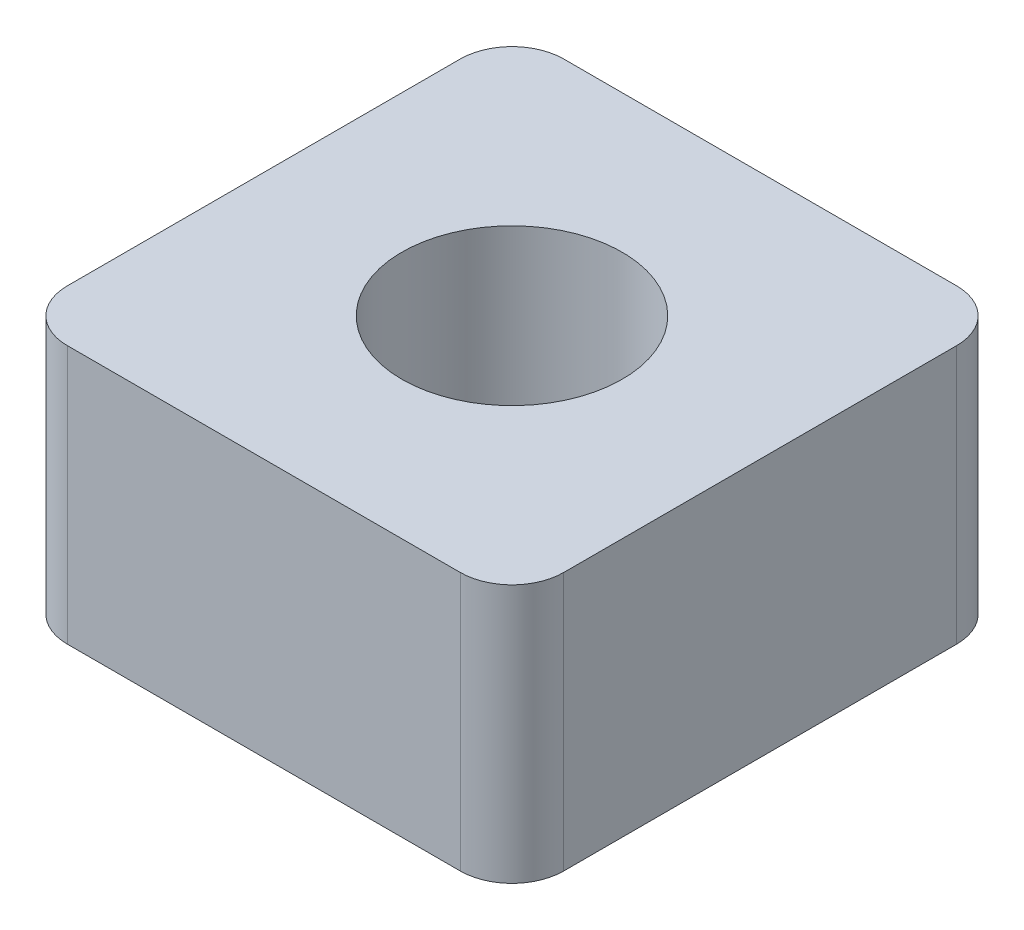
ISO-10303-21;
HEADER;
FILE_DESCRIPTION(('STEP AP214'),'2;1');
FILE_NAME('part.step','',(''),(''),'','','');
FILE_SCHEMA(('AUTOMOTIVE_DESIGN { 1 0 10303 214 1 1 1 1 }'));
ENDSEC;
DATA;
#1=APPLICATION_CONTEXT('core data for automotive mechanical design processes');
#2=APPLICATION_PROTOCOL_DEFINITION('international standard','automotive_design',2000,#1);
#3=PRODUCT_CONTEXT('',#1,'mechanical');
#4=PRODUCT('Part','Part','',(#3));
#5=PRODUCT_RELATED_PRODUCT_CATEGORY('part','',(#4));
#6=PRODUCT_DEFINITION_FORMATION('','',#4);
#7=PRODUCT_DEFINITION_CONTEXT('part definition',#1,'design');
#8=PRODUCT_DEFINITION('design','',#6,#7);
#9=PRODUCT_DEFINITION_SHAPE('','',#8);
#10=(LENGTH_UNIT() NAMED_UNIT(*) SI_UNIT(.MILLI.,.METRE.));
#11=(NAMED_UNIT(*) PLANE_ANGLE_UNIT() SI_UNIT($,.RADIAN.));
#12=(NAMED_UNIT(*) SI_UNIT($,.STERADIAN.) SOLID_ANGLE_UNIT());
#13=UNCERTAINTY_MEASURE_WITH_UNIT(LENGTH_MEASURE(1.E-05),#10,'distance_accuracy_value','');
#14=(GEOMETRIC_REPRESENTATION_CONTEXT(3) GLOBAL_UNCERTAINTY_ASSIGNED_CONTEXT((#13)) GLOBAL_UNIT_ASSIGNED_CONTEXT((#10,
#11,#12)) REPRESENTATION_CONTEXT('',''));
#15=CARTESIAN_POINT('',(0.,0.,0.));
#16=DIRECTION('',(0.,0.,1.));
#17=DIRECTION('',(1.,0.,0.));
#18=AXIS2_PLACEMENT_3D('',#15,#16,#17);
#19=CARTESIAN_POINT('',(2.413,3.175,-2.413));
#20=DIRECTION('',(0.,-1.,0.));
#21=DIRECTION('',(0.,0.,-1.));
#22=AXIS2_PLACEMENT_3D('',#19,#20,#21);
#23=CYLINDRICAL_SURFACE('',#22,0.635);
#24=CARTESIAN_POINT('',(2.413,0.,-2.413));
#25=DIRECTION('',(0.,-1.,0.));
#26=DIRECTION('',(0.,0.,-1.));
#27=AXIS2_PLACEMENT_3D('',#24,#25,#26);
#28=CIRCLE('',#27,0.635);
#29=CARTESIAN_POINT('',(2.413,0.,-3.048));
#30=VERTEX_POINT('',#29);
#31=CARTESIAN_POINT('',(3.048,0.,-2.413));
#32=VERTEX_POINT('',#31);
#33=EDGE_CURVE('E124',#30,#32,#28,.T.);
#34=ORIENTED_EDGE('',*,*,#33,.F.);
#35=DIRECTION('',(0.,1.,0.));
#36=VECTOR('',#35,1.);
#37=CARTESIAN_POINT('',(2.413,3.175,-3.048));
#38=LINE('',#37,#36);
#39=CARTESIAN_POINT('',(2.413,3.175,-3.048));
#40=VERTEX_POINT('',#39);
#41=EDGE_CURVE('E67',#30,#40,#38,.T.);
#42=ORIENTED_EDGE('',*,*,#41,.T.);
#43=CARTESIAN_POINT('',(2.413,3.175,-2.413));
#44=DIRECTION('',(0.,-1.,0.));
#45=DIRECTION('',(0.,0.,-1.));
#46=AXIS2_PLACEMENT_3D('',#43,#44,#45);
#47=CIRCLE('',#46,0.635);
#48=CARTESIAN_POINT('',(3.048,3.175,-2.413));
#49=VERTEX_POINT('',#48);
#50=EDGE_CURVE('E21',#40,#49,#47,.T.);
#51=ORIENTED_EDGE('',*,*,#50,.T.);
#52=DIRECTION('',(0.,1.,0.));
#53=VECTOR('',#52,1.);
#54=CARTESIAN_POINT('',(3.048,3.175,-2.413));
#55=LINE('',#54,#53);
#56=EDGE_CURVE('E65',#49,#32,#55,.F.);
#57=ORIENTED_EDGE('',*,*,#56,.T.);
#58=EDGE_LOOP('',(#34,#42,#51,#57));
#59=FACE_BOUND('',#58,.T.);
#60=ADVANCED_FACE('F18',(#59),#23,.T.);
#61=CARTESIAN_POINT('',(2.413,3.175,2.413));
#62=DIRECTION('',(0.,-1.,0.));
#63=DIRECTION('',(0.,0.,-1.));
#64=AXIS2_PLACEMENT_3D('',#61,#62,#63);
#65=CYLINDRICAL_SURFACE('',#64,0.635);
#66=CARTESIAN_POINT('',(2.413,0.,2.413));
#67=DIRECTION('',(0.,-1.,0.));
#68=DIRECTION('',(0.,0.,-1.));
#69=AXIS2_PLACEMENT_3D('',#66,#67,#68);
#70=CIRCLE('',#69,0.635);
#71=CARTESIAN_POINT('',(3.048,0.,2.413));
#72=VERTEX_POINT('',#71);
#73=CARTESIAN_POINT('',(2.413,0.,3.048));
#74=VERTEX_POINT('',#73);
#75=EDGE_CURVE('E121',#72,#74,#70,.T.);
#76=ORIENTED_EDGE('',*,*,#75,.F.);
#77=DIRECTION('',(0.,1.,0.));
#78=VECTOR('',#77,1.);
#79=CARTESIAN_POINT('',(3.048,3.175,2.413));
#80=LINE('',#79,#78);
#81=CARTESIAN_POINT('',(3.048,3.175,2.413));
#82=VERTEX_POINT('',#81);
#83=EDGE_CURVE('E78',#72,#82,#80,.T.);
#84=ORIENTED_EDGE('',*,*,#83,.T.);
#85=CARTESIAN_POINT('',(2.413,3.175,2.413));
#86=DIRECTION('',(0.,-1.,0.));
#87=DIRECTION('',(0.,0.,-1.));
#88=AXIS2_PLACEMENT_3D('',#85,#86,#87);
#89=CIRCLE('',#88,0.635);
#90=CARTESIAN_POINT('',(2.413,3.175,3.048));
#91=VERTEX_POINT('',#90);
#92=EDGE_CURVE('E69',#82,#91,#89,.T.);
#93=ORIENTED_EDGE('',*,*,#92,.T.);
#94=DIRECTION('',(0.,1.,0.));
#95=VECTOR('',#94,1.);
#96=CARTESIAN_POINT('',(2.413,3.175,3.048));
#97=LINE('',#96,#95);
#98=EDGE_CURVE('E98',#91,#74,#97,.F.);
#99=ORIENTED_EDGE('',*,*,#98,.T.);
#100=EDGE_LOOP('',(#76,#84,#93,#99));
#101=FACE_BOUND('',#100,.T.);
#102=ADVANCED_FACE('F138',(#101),#65,.T.);
#103=CARTESIAN_POINT('',(-2.413,3.175,-2.413));
#104=DIRECTION('',(0.,-1.,0.));
#105=DIRECTION('',(0.,0.,-1.));
#106=AXIS2_PLACEMENT_3D('',#103,#104,#105);
#107=CYLINDRICAL_SURFACE('',#106,0.635);
#108=CARTESIAN_POINT('',(-2.413,0.,-2.413));
#109=DIRECTION('',(0.,-1.,0.));
#110=DIRECTION('',(0.,0.,-1.));
#111=AXIS2_PLACEMENT_3D('',#108,#109,#110);
#112=CIRCLE('',#111,0.635);
#113=CARTESIAN_POINT('',(-3.048,0.,-2.413));
#114=VERTEX_POINT('',#113);
#115=CARTESIAN_POINT('',(-2.413,0.,-3.048));
#116=VERTEX_POINT('',#115);
#117=EDGE_CURVE('E127',#114,#116,#112,.T.);
#118=ORIENTED_EDGE('',*,*,#117,.F.);
#119=DIRECTION('',(0.,1.,0.));
#120=VECTOR('',#119,1.);
#121=CARTESIAN_POINT('',(-3.048,3.175,-2.413));
#122=LINE('',#121,#120);
#123=CARTESIAN_POINT('',(-3.048,3.175,-2.413));
#124=VERTEX_POINT('',#123);
#125=EDGE_CURVE('E94',#114,#124,#122,.T.);
#126=ORIENTED_EDGE('',*,*,#125,.T.);
#127=CARTESIAN_POINT('',(-2.413,3.175,-2.413));
#128=DIRECTION('',(0.,-1.,0.));
#129=DIRECTION('',(0.,0.,-1.));
#130=AXIS2_PLACEMENT_3D('',#127,#128,#129);
#131=CIRCLE('',#130,0.635);
#132=CARTESIAN_POINT('',(-2.413,3.175,-3.048));
#133=VERTEX_POINT('',#132);
#134=EDGE_CURVE('E134',#124,#133,#131,.T.);
#135=ORIENTED_EDGE('',*,*,#134,.T.);
#136=DIRECTION('',(0.,1.,0.));
#137=VECTOR('',#136,1.);
#138=CARTESIAN_POINT('',(-2.413,3.175,-3.048));
#139=LINE('',#138,#137);
#140=EDGE_CURVE('E105',#133,#116,#139,.F.);
#141=ORIENTED_EDGE('',*,*,#140,.T.);
#142=EDGE_LOOP('',(#118,#126,#135,#141));
#143=FACE_BOUND('',#142,.T.);
#144=ADVANCED_FACE('F168',(#143),#107,.T.);
#145=CARTESIAN_POINT('',(-2.413,3.175,2.413));
#146=DIRECTION('',(0.,-1.,0.));
#147=DIRECTION('',(0.,0.,-1.));
#148=AXIS2_PLACEMENT_3D('',#145,#146,#147);
#149=CYLINDRICAL_SURFACE('',#148,0.635);
#150=CARTESIAN_POINT('',(-2.413,0.,2.413));
#151=DIRECTION('',(0.,-1.,0.));
#152=DIRECTION('',(0.,0.,-1.));
#153=AXIS2_PLACEMENT_3D('',#150,#151,#152);
#154=CIRCLE('',#153,0.635);
#155=CARTESIAN_POINT('',(-2.413,0.,3.048));
#156=VERTEX_POINT('',#155);
#157=CARTESIAN_POINT('',(-3.048,0.,2.413));
#158=VERTEX_POINT('',#157);
#159=EDGE_CURVE('E130',#156,#158,#154,.T.);
#160=ORIENTED_EDGE('',*,*,#159,.F.);
#161=DIRECTION('',(0.,1.,0.));
#162=VECTOR('',#161,1.);
#163=CARTESIAN_POINT('',(-2.413,3.175,3.048));
#164=LINE('',#163,#162);
#165=CARTESIAN_POINT('',(-2.413,3.175,3.048));
#166=VERTEX_POINT('',#165);
#167=EDGE_CURVE('E97',#156,#166,#164,.T.);
#168=ORIENTED_EDGE('',*,*,#167,.T.);
#169=CARTESIAN_POINT('',(-2.413,3.175,2.413));
#170=DIRECTION('',(0.,-1.,0.));
#171=DIRECTION('',(0.,0.,-1.));
#172=AXIS2_PLACEMENT_3D('',#169,#170,#171);
#173=CIRCLE('',#172,0.635);
#174=CARTESIAN_POINT('',(-3.048,3.175,2.413));
#175=VERTEX_POINT('',#174);
#176=EDGE_CURVE('E36',#166,#175,#173,.T.);
#177=ORIENTED_EDGE('',*,*,#176,.T.);
#178=DIRECTION('',(0.,1.,0.));
#179=VECTOR('',#178,1.);
#180=CARTESIAN_POINT('',(-3.048,3.175,2.413));
#181=LINE('',#180,#179);
#182=EDGE_CURVE('E91',#175,#158,#181,.F.);
#183=ORIENTED_EDGE('',*,*,#182,.T.);
#184=EDGE_LOOP('',(#160,#168,#177,#183));
#185=FACE_BOUND('',#184,.T.);
#186=ADVANCED_FACE('F146',(#185),#149,.T.);
#187=CARTESIAN_POINT('',(0.,0.,0.));
#188=DIRECTION('',(0.,-1.,0.));
#189=DIRECTION('',(0.,0.,-1.));
#190=AXIS2_PLACEMENT_3D('',#187,#188,#189);
#191=PLANE('',#190);
#192=DIRECTION('',(0.,0.,1.));
#193=VECTOR('',#192,1.);
#194=CARTESIAN_POINT('',(3.048,0.,3.048));
#195=LINE('',#194,#193);
#196=EDGE_CURVE('E77',#32,#72,#195,.T.);
#197=ORIENTED_EDGE('',*,*,#196,.T.);
#198=ORIENTED_EDGE('',*,*,#75,.T.);
#199=DIRECTION('',(-1.,0.,0.));
#200=VECTOR('',#199,1.);
#201=CARTESIAN_POINT('',(-3.048,0.,3.048));
#202=LINE('',#201,#200);
#203=EDGE_CURVE('E101',#74,#156,#202,.T.);
#204=ORIENTED_EDGE('',*,*,#203,.T.);
#205=ORIENTED_EDGE('',*,*,#159,.T.);
#206=DIRECTION('',(0.,0.,-1.));
#207=VECTOR('',#206,1.);
#208=CARTESIAN_POINT('',(-3.048,0.,3.048));
#209=LINE('',#208,#207);
#210=EDGE_CURVE('E93',#158,#114,#209,.T.);
#211=ORIENTED_EDGE('',*,*,#210,.T.);
#212=ORIENTED_EDGE('',*,*,#117,.T.);
#213=DIRECTION('',(1.,0.,0.));
#214=VECTOR('',#213,1.);
#215=CARTESIAN_POINT('',(-3.048,0.,-3.048));
#216=LINE('',#215,#214);
#217=EDGE_CURVE('E104',#116,#30,#216,.T.);
#218=ORIENTED_EDGE('',*,*,#217,.T.);
#219=ORIENTED_EDGE('',*,*,#33,.T.);
#220=EDGE_LOOP('',(#197,#198,#204,#205,#211,#212,#218,#219));
#221=FACE_BOUND('',#220,.T.);
#222=CARTESIAN_POINT('',(0.,0.,0.));
#223=DIRECTION('',(0.,1.,0.));
#224=DIRECTION('',(0.,0.,1.));
#225=AXIS2_PLACEMENT_3D('',#222,#223,#224);
#226=CIRCLE('',#225,1.35254999999999);
#227=CARTESIAN_POINT('',(0.,0.,1.35254999999999));
#228=VERTEX_POINT('',#227);
#229=EDGE_CURVE('E109',#228,#228,#226,.T.);
#230=ORIENTED_EDGE('',*,*,#229,.T.);
#231=EDGE_LOOP('',(#230));
#232=FACE_BOUND('',#231,.T.);
#233=ADVANCED_FACE('F151',(#221,#232),#191,.T.);
#234=CARTESIAN_POINT('',(0.,3.175,0.));
#235=DIRECTION('',(0.,1.,0.));
#236=DIRECTION('',(0.,0.,1.));
#237=AXIS2_PLACEMENT_3D('',#234,#235,#236);
#238=CYLINDRICAL_SURFACE('',#237,1.35254999999999);
#239=ORIENTED_EDGE('',*,*,#229,.F.);
#240=EDGE_LOOP('',(#239));
#241=FACE_BOUND('',#240,.T.);
#242=CARTESIAN_POINT('',(0.,3.175,0.));
#243=DIRECTION('',(0.,1.,0.));
#244=DIRECTION('',(0.,0.,1.));
#245=AXIS2_PLACEMENT_3D('',#242,#243,#244);
#246=CIRCLE('',#245,1.35254999999999);
#247=CARTESIAN_POINT('',(0.,3.175,1.35254999999999));
#248=VERTEX_POINT('',#247);
#249=EDGE_CURVE('E88',#248,#248,#246,.T.);
#250=ORIENTED_EDGE('',*,*,#249,.T.);
#251=EDGE_LOOP('',(#250));
#252=FACE_BOUND('',#251,.T.);
#253=ADVANCED_FACE('F174',(#241,#252),#238,.F.);
#254=CARTESIAN_POINT('',(-3.048,3.175,-3.048));
#255=DIRECTION('',(0.,0.,1.));
#256=DIRECTION('',(1.,0.,0.));
#257=AXIS2_PLACEMENT_3D('',#254,#255,#256);
#258=PLANE('',#257);
#259=ORIENTED_EDGE('',*,*,#140,.F.);
#260=DIRECTION('',(1.,0.,0.));
#261=VECTOR('',#260,1.);
#262=CARTESIAN_POINT('',(0.,3.175,-3.048));
#263=LINE('',#262,#261);
#264=EDGE_CURVE('E84',#133,#40,#263,.T.);
#265=ORIENTED_EDGE('',*,*,#264,.T.);
#266=ORIENTED_EDGE('',*,*,#41,.F.);
#267=ORIENTED_EDGE('',*,*,#217,.F.);
#268=EDGE_LOOP('',(#259,#265,#266,#267));
#269=FACE_BOUND('',#268,.T.);
#270=ADVANCED_FACE('F172',(#269),#258,.F.);
#271=CARTESIAN_POINT('',(3.048,3.175,3.048));
#272=DIRECTION('',(-1.,0.,0.));
#273=DIRECTION('',(0.,0.,1.));
#274=AXIS2_PLACEMENT_3D('',#271,#272,#273);
#275=PLANE('',#274);
#276=ORIENTED_EDGE('',*,*,#56,.F.);
#277=DIRECTION('',(0.,0.,-1.));
#278=VECTOR('',#277,1.);
#279=CARTESIAN_POINT('',(3.048,3.175,0.));
#280=LINE('',#279,#278);
#281=EDGE_CURVE('E75',#49,#82,#280,.F.);
#282=ORIENTED_EDGE('',*,*,#281,.T.);
#283=ORIENTED_EDGE('',*,*,#83,.F.);
#284=ORIENTED_EDGE('',*,*,#196,.F.);
#285=EDGE_LOOP('',(#276,#282,#283,#284));
#286=FACE_BOUND('',#285,.T.);
#287=ADVANCED_FACE('F73',(#286),#275,.F.);
#288=CARTESIAN_POINT('',(-3.048,3.175,3.048));
#289=DIRECTION('',(0.,0.,-1.));
#290=DIRECTION('',(-1.,0.,0.));
#291=AXIS2_PLACEMENT_3D('',#288,#289,#290);
#292=PLANE('',#291);
#293=ORIENTED_EDGE('',*,*,#167,.F.);
#294=ORIENTED_EDGE('',*,*,#203,.F.);
#295=ORIENTED_EDGE('',*,*,#98,.F.);
#296=DIRECTION('',(1.,0.,0.));
#297=VECTOR('',#296,1.);
#298=CARTESIAN_POINT('',(0.,3.175,3.048));
#299=LINE('',#298,#297);
#300=EDGE_CURVE('E27',#91,#166,#299,.F.);
#301=ORIENTED_EDGE('',*,*,#300,.T.);
#302=EDGE_LOOP('',(#293,#294,#295,#301));
#303=FACE_BOUND('',#302,.T.);
#304=ADVANCED_FACE('F143',(#303),#292,.F.);
#305=CARTESIAN_POINT('',(-3.048,3.175,3.048));
#306=DIRECTION('',(1.,0.,0.));
#307=DIRECTION('',(0.,0.,-1.));
#308=AXIS2_PLACEMENT_3D('',#305,#306,#307);
#309=PLANE('',#308);
#310=ORIENTED_EDGE('',*,*,#182,.F.);
#311=DIRECTION('',(0.,0.,-1.));
#312=VECTOR('',#311,1.);
#313=CARTESIAN_POINT('',(-3.048,3.175,0.));
#314=LINE('',#313,#312);
#315=EDGE_CURVE('E11',#175,#124,#314,.T.);
#316=ORIENTED_EDGE('',*,*,#315,.T.);
#317=ORIENTED_EDGE('',*,*,#125,.F.);
#318=ORIENTED_EDGE('',*,*,#210,.F.);
#319=EDGE_LOOP('',(#310,#316,#317,#318));
#320=FACE_BOUND('',#319,.T.);
#321=ADVANCED_FACE('F166',(#320),#309,.F.);
#322=CARTESIAN_POINT('',(0.,3.175,0.));
#323=DIRECTION('',(0.,-1.,0.));
#324=DIRECTION('',(0.,0.,-1.));
#325=AXIS2_PLACEMENT_3D('',#322,#323,#324);
#326=PLANE('',#325);
#327=ORIENTED_EDGE('',*,*,#176,.F.);
#328=ORIENTED_EDGE('',*,*,#300,.F.);
#329=ORIENTED_EDGE('',*,*,#92,.F.);
#330=ORIENTED_EDGE('',*,*,#281,.F.);
#331=ORIENTED_EDGE('',*,*,#50,.F.);
#332=ORIENTED_EDGE('',*,*,#264,.F.);
#333=ORIENTED_EDGE('',*,*,#134,.F.);
#334=ORIENTED_EDGE('',*,*,#315,.F.);
#335=EDGE_LOOP('',(#327,#328,#329,#330,#331,#332,#333,#334));
#336=FACE_BOUND('',#335,.T.);
#337=ORIENTED_EDGE('',*,*,#249,.F.);
#338=EDGE_LOOP('',(#337));
#339=FACE_BOUND('',#338,.T.);
#340=ADVANCED_FACE('F80',(#336,#339),#326,.F.);
#341=CLOSED_SHELL('',(#60,#102,#144,#186,#233,#253,#270,#287,#304,#321,#340));
#342=MANIFOLD_SOLID_BREP('B1',#341);
#343=ADVANCED_BREP_SHAPE_REPRESENTATION('',(#18,#342),#14);
#344=SHAPE_DEFINITION_REPRESENTATION(#9,#343);
ENDSEC;
END-ISO-10303-21;
